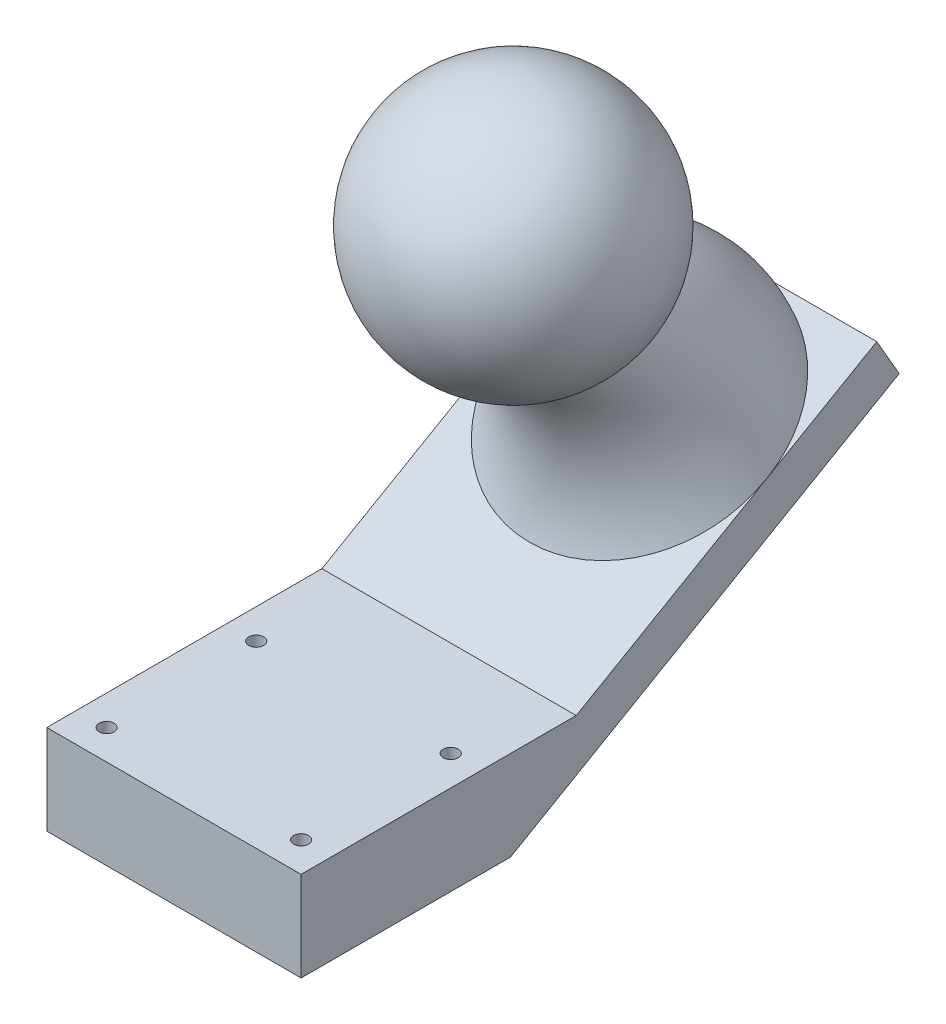
ISO-10303-21;
HEADER;
FILE_DESCRIPTION(('STEP AP214'),'2;1');
FILE_NAME('part.step','',(''),(''),'','','');
FILE_SCHEMA(('AUTOMOTIVE_DESIGN { 1 0 10303 214 1 1 1 1 }'));
ENDSEC;
DATA;
#1=APPLICATION_CONTEXT('core data for automotive mechanical design processes');
#2=APPLICATION_PROTOCOL_DEFINITION('international standard','automotive_design',2000,#1);
#3=PRODUCT_CONTEXT('',#1,'mechanical');
#4=PRODUCT('Part','Part','',(#3));
#5=PRODUCT_RELATED_PRODUCT_CATEGORY('part','',(#4));
#6=PRODUCT_DEFINITION_FORMATION('','',#4);
#7=PRODUCT_DEFINITION_CONTEXT('part definition',#1,'design');
#8=PRODUCT_DEFINITION('design','',#6,#7);
#9=PRODUCT_DEFINITION_SHAPE('','',#8);
#10=(LENGTH_UNIT() NAMED_UNIT(*) SI_UNIT(.MILLI.,.METRE.));
#11=(NAMED_UNIT(*) PLANE_ANGLE_UNIT() SI_UNIT($,.RADIAN.));
#12=(NAMED_UNIT(*) SI_UNIT($,.STERADIAN.) SOLID_ANGLE_UNIT());
#13=UNCERTAINTY_MEASURE_WITH_UNIT(LENGTH_MEASURE(1.E-05),#10,'distance_accuracy_value','');
#14=(GEOMETRIC_REPRESENTATION_CONTEXT(3) GLOBAL_UNCERTAINTY_ASSIGNED_CONTEXT((#13)) GLOBAL_UNIT_ASSIGNED_CONTEXT((#10,
#11,#12)) REPRESENTATION_CONTEXT('',''));
#15=CARTESIAN_POINT('',(0.,0.,0.));
#16=DIRECTION('',(0.,0.,1.));
#17=DIRECTION('',(1.,0.,0.));
#18=AXIS2_PLACEMENT_3D('',#15,#16,#17);
#19=CARTESIAN_POINT('',(8.5,6.,-4.39230484541324));
#20=DIRECTION('',(0.,0.866025403784438,0.500000000000002));
#21=DIRECTION('',(0.,-0.500000000000002,0.866025403784438));
#22=AXIS2_PLACEMENT_3D('',#19,#20,#21);
#23=PLANE('',#22);
#24=DIRECTION('',(0.,0.500000000000002,-0.866025403784438));
#25=VECTOR('',#24,1.);
#26=CARTESIAN_POINT('',(-8.5,6.,-4.39230484541324));
#27=LINE('',#26,#25);
#28=CARTESIAN_POINT('',(-8.5,13.3482129095332,-17.1197829495582));
#29=VERTEX_POINT('',#28);
#30=CARTESIAN_POINT('',(-8.5,17.5980762113534,-24.4807621135331));
#31=VERTEX_POINT('',#30);
#32=EDGE_CURVE('E303',#29,#31,#27,.T.);
#33=ORIENTED_EDGE('',*,*,#32,.F.);
#34=CARTESIAN_POINT('',(0.,13.3480762113533,-17.1195461813654));
#35=DIRECTION('',(0.,0.866025403784438,0.500000000000002));
#36=DIRECTION('',(0.,-0.500000000000002,0.866025403784438));
#37=AXIS2_PLACEMENT_3D('',#34,#35,#36);
#38=CIRCLE('',#37,8.5);
#39=CARTESIAN_POINT('',(0.000270163860237178,17.5980762134011,-24.4807621170799));
#40=VERTEX_POINT('',#39);
#41=EDGE_CURVE('E258',#40,#29,#38,.T.);
#42=ORIENTED_EDGE('',*,*,#41,.F.);
#43=DIRECTION('',(-1.,0.,0.));
#44=VECTOR('',#43,1.);
#45=CARTESIAN_POINT('',(8.5,17.5980762113534,-24.4807621135331));
#46=LINE('',#45,#44);
#47=EDGE_CURVE('E301',#40,#31,#46,.T.);
#48=ORIENTED_EDGE('',*,*,#47,.T.);
#49=EDGE_LOOP('',(#33,#42,#48));
#50=FACE_BOUND('',#49,.T.);
#51=ADVANCED_FACE('F55',(#50),#23,.T.);
#52=CARTESIAN_POINT('',(8.5,17.5980762113534,-24.4807621135331));
#53=VERTEX_POINT('',#52);
#54=EDGE_CURVE('E290',#53,#40,#46,.T.);
#55=ORIENTED_EDGE('',*,*,#54,.T.);
#56=CARTESIAN_POINT('',(8.50000000409541,13.3479411294302,-17.1193122126113));
#57=VERTEX_POINT('',#56);
#58=EDGE_CURVE('E257',#57,#40,#38,.T.);
#59=ORIENTED_EDGE('',*,*,#58,.F.);
#60=DIRECTION('',(0.,0.500000000000002,-0.866025403784438));
#61=VECTOR('',#60,1.);
#62=CARTESIAN_POINT('',(8.5,6.,-4.39230484541324));
#63=LINE('',#62,#61);
#64=EDGE_CURVE('E317',#57,#53,#63,.T.);
#65=ORIENTED_EDGE('',*,*,#64,.T.);
#66=EDGE_LOOP('',(#55,#59,#65));
#67=FACE_BOUND('',#66,.T.);
#68=ADVANCED_FACE('F278',(#67),#23,.T.);
#69=CARTESIAN_POINT('',(8.5,6.,-4.39230484541324));
#70=VERTEX_POINT('',#69);
#71=EDGE_CURVE('E327',#70,#57,#63,.T.);
#72=ORIENTED_EDGE('',*,*,#71,.T.);
#73=CARTESIAN_POINT('',(-8.49999999568817,13.3482129095331,-17.1197829495581));
#74=CARTESIAN_POINT('',(-8.5000046715156,13.2887034850382,-17.0167096028036));
#75=CARTESIAN_POINT('',(-8.49755549484888,13.2292004426964,-16.9136473102628));
#76=CARTESIAN_POINT('',(-8.48771954843888,13.1102952719052,-16.7076975131697));
#77=CARTESIAN_POINT('',(-8.48033266881722,13.0508931457308,-16.6048100125582));
#78=CARTESIAN_POINT('',(-8.45072461534215,12.8729972477273,-16.296685278758));
#79=CARTESIAN_POINT('',(-8.42105605135495,12.7547909079255,-16.0919458924444));
#80=CARTESIAN_POINT('',(-8.34194115452395,12.5202013837619,-15.6856249176696));
#81=CARTESIAN_POINT('',(-8.29251813919331,12.4038162174582,-15.4840398963843));
#82=CARTESIAN_POINT('',(-8.17417754220588,12.173551682799,-15.0852100231734));
#83=CARTESIAN_POINT('',(-8.10526083235084,12.059672202629,-14.8879649775794));
#84=CARTESIAN_POINT('',(-7.94809771028551,11.834757999239,-14.498402149964));
#85=CARTESIAN_POINT('',(-7.85977069841537,11.7237373608183,-14.3061087635307));
#86=CARTESIAN_POINT('',(-7.6646088883301,11.5057899235463,-13.9286127287961));
#87=CARTESIAN_POINT('',(-7.55776698635949,11.3988647153187,-13.7434128355361));
#88=CARTESIAN_POINT('',(-7.32648703191566,11.1899460516747,-13.3815550954552));
#89=CARTESIAN_POINT('',(-7.20205678099877,11.087950436442,-13.2048935077229));
#90=CARTESIAN_POINT('',(-6.93645499379009,10.8894958204098,-12.8611600297586));
#91=CARTESIAN_POINT('',(-6.79527579600948,10.7930393835744,-12.6940925804428));
#92=CARTESIAN_POINT('',(-6.49740607478641,10.6064613933737,-12.370930021841));
#93=CARTESIAN_POINT('',(-6.34073018601016,10.5163339980357,-12.2148247939616));
#94=CARTESIAN_POINT('',(-6.01294982157987,10.3429738106612,-11.9145561414194));
#95=CARTESIAN_POINT('',(-5.84185188736856,10.2597379264236,-11.7703873609069));
#96=CARTESIAN_POINT('',(-5.48626517091618,10.1006578846614,-11.4948526461047));
#97=CARTESIAN_POINT('',(-5.30176965205638,10.0248174912959,-11.3634932315297));
#98=CARTESIAN_POINT('',(-4.92079630012413,9.88114915778041,-11.114652378442));
#99=CARTESIAN_POINT('',(-4.7243227069887,9.81331840710198,-10.9971660719515));
#100=CARTESIAN_POINT('',(-4.31903465673269,9.68562771689373,-10.7759993088573));
#101=CARTESIAN_POINT('',(-4.11013291027329,9.6258370083211,-10.6724387637889));
#102=CARTESIAN_POINT('',(-3.68291608248526,9.51535004836034,-10.481069735563));
#103=CARTESIAN_POINT('',(-3.46460089344501,9.46465390106936,-10.3932614327071));
#104=CARTESIAN_POINT('',(-3.02014171754443,9.37276627920696,-10.2341074030547));
#105=CARTESIAN_POINT('',(-2.7939987325556,9.33157359343237,-10.1627595783929));
#106=CARTESIAN_POINT('',(-2.33550079429345,9.25900737562557,-10.0370712022384));
#107=CARTESIAN_POINT('',(-2.10314597285683,9.22763363538059,-9.98273029011067));
#108=CARTESIAN_POINT('',(-1.63668122758367,9.17523105066468,-9.89196635093478));
#109=CARTESIAN_POINT('',(-1.4026238132527,9.15408524168239,-9.85534073541029));
#110=CARTESIAN_POINT('',(-0.931778886495475,9.12169917804822,-9.79924642773874));
#111=CARTESIAN_POINT('',(-0.694991265740385,9.11045931782318,-9.779778418759));
#112=CARTESIAN_POINT('',(-0.220338080889434,9.09782906898204,-9.75790218605392));
#113=CARTESIAN_POINT('',(0.0175276456158153,9.09644021728159,-9.75549662434455));
#114=CARTESIAN_POINT('',(0.492677739391023,9.10347504253636,-9.76768129910818));
#115=CARTESIAN_POINT('',(0.72996211698129,9.11189854401574,-9.78227123164812));
#116=CARTESIAN_POINT('',(1.20486318836936,9.1388085843262,-9.82888078869957));
#117=CARTESIAN_POINT('',(1.44245540385567,9.15740362315673,-9.86108834072274));
#118=CARTESIAN_POINT('',(1.91360524252567,9.20465237200648,-9.94292557432456));
#119=CARTESIAN_POINT('',(2.14716287538857,9.23330605789083,-9.99255521410038));
#120=CARTESIAN_POINT('',(2.60842788032053,9.30047154516105,-10.1088892505675));
#121=CARTESIAN_POINT('',(2.83613775014163,9.33897905794871,-10.1755862191888));
#122=CARTESIAN_POINT('',(3.28424398240051,9.4255794296032,-10.3255824628488));
#123=CARTESIAN_POINT('',(3.50463755286589,9.47367589975687,-10.4088879928197));
#124=CARTESIAN_POINT('',(3.93385254520007,9.57842964756454,-10.5903268063058));
#125=CARTESIAN_POINT('',(4.14278111315103,9.63497724338792,-10.6882701153178));
#126=CARTESIAN_POINT('',(4.55053616203044,9.75663981363738,-10.8989958683692));
#127=CARTESIAN_POINT('',(4.74935804353668,9.82175864118152,-11.011784986205));
#128=CARTESIAN_POINT('',(5.13549103796111,9.96007195610834,-11.2513506750215));
#129=CARTESIAN_POINT('',(5.32279968622117,10.0332681633202,-11.3781302248338));
#130=CARTESIAN_POINT('',(5.68451116830758,10.18716207373,-11.6446822966391));
#131=CARTESIAN_POINT('',(5.85891964573066,10.2678564613263,-11.7844490758415));
#132=CARTESIAN_POINT('',(6.19537346923552,10.4370373933018,-12.0774790456949));
#133=CARTESIAN_POINT('',(6.35728060925496,10.5255926678275,-12.2308612804516));
#134=CARTESIAN_POINT('',(6.66559840699883,10.7091557605467,-12.5488018834357));
#135=CARTESIAN_POINT('',(6.81201446751631,10.8041613099854,-12.7133563220647));
#136=CARTESIAN_POINT('',(7.08837735624924,11.0000272020441,-13.0526059985801));
#137=CARTESIAN_POINT('',(7.218319230574,11.1008892925317,-13.2273042638621));
#138=CARTESIAN_POINT('',(7.46068520599489,11.3077414443327,-13.5855827004365));
#139=CARTESIAN_POINT('',(7.57310990567126,11.4137313302618,-13.7691625679541));
#140=CARTESIAN_POINT('',(7.77966565539353,11.6302070788897,-14.1441095631841));
#141=CARTESIAN_POINT('',(7.87377855612231,11.7406972721528,-14.335484191654));
#142=CARTESIAN_POINT('',(8.04282489572624,11.965284685763,-14.7244810027672));
#143=CARTESIAN_POINT('',(8.1177588821934,12.0793818030214,-14.9221030068559));
#144=CARTESIAN_POINT('',(8.24780724857376,12.3102192323075,-15.321925162668));
#145=CARTESIAN_POINT('',(8.3029445573503,12.4269563189343,-15.5241197278332));
#146=CARTESIAN_POINT('',(8.39314972476335,12.6623051253161,-15.9317558179872));
#147=CARTESIAN_POINT('',(8.42822723234696,12.7809159155404,-16.1371957329815));
#148=CARTESIAN_POINT('',(8.46886727489162,12.9744816278123,-16.4724613812398));
#149=CARTESIAN_POINT('',(8.48056509334272,13.0491286594026,-16.6017538325884));
#150=CARTESIAN_POINT('',(8.49612465157065,13.1984954980506,-16.8604647860926));
#151=CARTESIAN_POINT('',(8.50000010898411,13.2732149474146,-16.9898826687047));
#152=CARTESIAN_POINT('',(8.49999999578952,13.3479411294303,-17.1193122126116));
#153=B_SPLINE_CURVE_WITH_KNOTS('',3,(#73,#74,#75,#76,#77,#78,#79,#80,#81,#82,#83,#84,#85,#86,
#87,#88,#89,#90,#91,#92,#93,#94,#95,#96,#97,#98,#99,#100,#101,#102,#103,#104,#105,#106,#107,
#108,#109,#110,#111,#112,#113,#114,#115,#116,#117,#118,#119,#120,#121,#122,#123,#124,#125,#126,
#127,#128,#129,#130,#131,#132,#133,#134,#135,#136,#137,#138,#139,#140,#141,#142,#143,#144,#145,
#146,#147,#148,#149,#150,#151,#152),.UNSPECIFIED.,.F.,.F.,(4,2,2,2,2,2,2,2,2,2,2,2,2,2,2,2,2,2,
2,2,2,2,2,2,2,2,2,2,2,2,2,2,2,2,2,2,2,2,2,4),(0.,0.357004706186308,0.714017357039228,
1.42790480233957,2.14095207482741,2.85396746328307,3.57000149847078,4.28631087087501,
5.00230350558294,5.71862492964286,6.43427622290346,7.14960464534207,7.86529527598882,
8.58073402473807,9.30198494270008,10.0232441156373,10.7444113142363,11.4655632192997,
12.1782608390823,12.8909868351847,13.6038240255509,14.3166484683347,15.0372292549094,
15.7578083125234,16.4780742903847,17.1986120409923,17.9105013918265,18.6227118659602,
19.3350742770315,20.0471231758822,20.7661635598748,21.4849523331175,22.2039567405413,
22.9229365734392,23.6426254167442,24.3622937093642,25.0811257598948,25.7996117542024,
26.2486782105421,26.6969564775867),.UNSPECIFIED.);
#154=EDGE_CURVE('E264',#29,#57,#153,.T.);
#155=ORIENTED_EDGE('',*,*,#154,.F.);
#156=CARTESIAN_POINT('',(-8.5,6.,-4.39230484541324));
#157=VERTEX_POINT('',#156);
#158=EDGE_CURVE('E356',#157,#29,#27,.T.);
#159=ORIENTED_EDGE('',*,*,#158,.F.);
#160=DIRECTION('',(-1.,0.,0.));
#161=VECTOR('',#160,1.);
#162=CARTESIAN_POINT('',(8.5,6.,-4.39230484541324));
#163=LINE('',#162,#161);
#164=EDGE_CURVE('E314',#70,#157,#163,.T.);
#165=ORIENTED_EDGE('',*,*,#164,.F.);
#166=EDGE_LOOP('',(#72,#155,#159,#165));
#167=FACE_BOUND('',#166,.T.);
#168=ADVANCED_FACE('F280',(#167),#23,.T.);
#169=CARTESIAN_POINT('',(8.5,0.,14.));
#170=DIRECTION('',(0.,0.,1.));
#171=DIRECTION('',(1.,0.,0.));
#172=AXIS2_PLACEMENT_3D('',#169,#170,#171);
#173=PLANE('',#172);
#174=DIRECTION('',(0.,1.,0.));
#175=VECTOR('',#174,1.);
#176=CARTESIAN_POINT('',(-8.5,0.,14.));
#177=LINE('',#176,#175);
#178=CARTESIAN_POINT('',(-8.5,0.,14.));
#179=VERTEX_POINT('',#178);
#180=CARTESIAN_POINT('',(-8.5,6.,14.));
#181=VERTEX_POINT('',#180);
#182=EDGE_CURVE('E163',#179,#181,#177,.T.);
#183=ORIENTED_EDGE('',*,*,#182,.F.);
#184=DIRECTION('',(-1.,0.,0.));
#185=VECTOR('',#184,1.);
#186=CARTESIAN_POINT('',(8.5,0.,14.));
#187=LINE('',#186,#185);
#188=CARTESIAN_POINT('',(8.5,0.,14.));
#189=VERTEX_POINT('',#188);
#190=EDGE_CURVE('E13',#189,#179,#187,.T.);
#191=ORIENTED_EDGE('',*,*,#190,.F.);
#192=DIRECTION('',(0.,1.,0.));
#193=VECTOR('',#192,1.);
#194=CARTESIAN_POINT('',(8.5,0.,14.));
#195=LINE('',#194,#193);
#196=CARTESIAN_POINT('',(8.5,6.,14.));
#197=VERTEX_POINT('',#196);
#198=EDGE_CURVE('E369',#189,#197,#195,.T.);
#199=ORIENTED_EDGE('',*,*,#198,.T.);
#200=DIRECTION('',(-1.,0.,0.));
#201=VECTOR('',#200,1.);
#202=CARTESIAN_POINT('',(8.5,6.,14.));
#203=LINE('',#202,#201);
#204=EDGE_CURVE('E345',#197,#181,#203,.T.);
#205=ORIENTED_EDGE('',*,*,#204,.T.);
#206=EDGE_LOOP('',(#183,#191,#199,#205));
#207=FACE_BOUND('',#206,.T.);
#208=ADVANCED_FACE('F57',(#207),#173,.T.);
#209=CARTESIAN_POINT('',(8.5,0.,0.));
#210=DIRECTION('',(0.,-1.,0.));
#211=DIRECTION('',(0.,0.,-1.));
#212=AXIS2_PLACEMENT_3D('',#209,#210,#211);
#213=PLANE('',#212);
#214=CARTESIAN_POINT('',(-6.5,0.,2.));
#215=DIRECTION('',(0.,1.,0.));
#216=DIRECTION('',(0.,0.,1.));
#217=AXIS2_PLACEMENT_3D('',#214,#215,#216);
#218=CIRCLE('',#217,0.500000000000001);
#219=CARTESIAN_POINT('',(-6.5,0.,2.5));
#220=VERTEX_POINT('',#219);
#221=EDGE_CURVE('E478',#220,#220,#218,.T.);
#222=ORIENTED_EDGE('',*,*,#221,.T.);
#223=EDGE_LOOP('',(#222));
#224=FACE_BOUND('',#223,.T.);
#225=CARTESIAN_POINT('',(6.5,0.,2.));
#226=DIRECTION('',(0.,1.,0.));
#227=DIRECTION('',(0.,0.,1.));
#228=AXIS2_PLACEMENT_3D('',#225,#226,#227);
#229=CIRCLE('',#228,0.500000000000001);
#230=CARTESIAN_POINT('',(6.5,0.,2.5));
#231=VERTEX_POINT('',#230);
#232=EDGE_CURVE('E530',#231,#231,#229,.T.);
#233=ORIENTED_EDGE('',*,*,#232,.T.);
#234=EDGE_LOOP('',(#233));
#235=FACE_BOUND('',#234,.T.);
#236=CARTESIAN_POINT('',(6.5,0.,12.));
#237=DIRECTION('',(0.,1.,0.));
#238=DIRECTION('',(0.,0.,1.));
#239=AXIS2_PLACEMENT_3D('',#236,#237,#238);
#240=CIRCLE('',#239,0.500000000000001);
#241=CARTESIAN_POINT('',(6.5,0.,12.5));
#242=VERTEX_POINT('',#241);
#243=EDGE_CURVE('E492',#242,#242,#240,.T.);
#244=ORIENTED_EDGE('',*,*,#243,.T.);
#245=EDGE_LOOP('',(#244));
#246=FACE_BOUND('',#245,.T.);
#247=CARTESIAN_POINT('',(-6.5,0.,12.));
#248=DIRECTION('',(0.,1.,0.));
#249=DIRECTION('',(0.,0.,1.));
#250=AXIS2_PLACEMENT_3D('',#247,#248,#249);
#251=CIRCLE('',#250,0.500000000000001);
#252=CARTESIAN_POINT('',(-6.5,0.,12.5));
#253=VERTEX_POINT('',#252);
#254=EDGE_CURVE('E487',#253,#253,#251,.T.);
#255=ORIENTED_EDGE('',*,*,#254,.T.);
#256=EDGE_LOOP('',(#255));
#257=FACE_BOUND('',#256,.T.);
#258=DIRECTION('',(0.,0.,1.));
#259=VECTOR('',#258,1.);
#260=CARTESIAN_POINT('',(-8.5,0.,0.));
#261=LINE('',#260,#259);
#262=CARTESIAN_POINT('',(-8.5,0.,0.));
#263=VERTEX_POINT('',#262);
#264=EDGE_CURVE('E364',#263,#179,#261,.T.);
#265=ORIENTED_EDGE('',*,*,#264,.F.);
#266=DIRECTION('',(-1.,0.,0.));
#267=VECTOR('',#266,1.);
#268=CARTESIAN_POINT('',(8.5,0.,0.));
#269=LINE('',#268,#267);
#270=CARTESIAN_POINT('',(8.5,0.,0.));
#271=VERTEX_POINT('',#270);
#272=EDGE_CURVE('E65',#271,#263,#269,.T.);
#273=ORIENTED_EDGE('',*,*,#272,.F.);
#274=DIRECTION('',(0.,0.,1.));
#275=VECTOR('',#274,1.);
#276=CARTESIAN_POINT('',(8.5,0.,0.));
#277=LINE('',#276,#275);
#278=EDGE_CURVE('E342',#271,#189,#277,.T.);
#279=ORIENTED_EDGE('',*,*,#278,.T.);
#280=ORIENTED_EDGE('',*,*,#190,.T.);
#281=EDGE_LOOP('',(#265,#273,#279,#280));
#282=FACE_BOUND('',#281,.T.);
#283=ADVANCED_FACE('F367',(#224,#235,#246,#257,#282),#213,.T.);
#284=CARTESIAN_POINT('',(8.5,15.,-25.9807621135331));
#285=DIRECTION('',(0.,-0.866025403784438,-0.500000000000001));
#286=DIRECTION('',(0.,0.500000000000001,-0.866025403784438));
#287=AXIS2_PLACEMENT_3D('',#284,#285,#286);
#288=PLANE('',#287);
#289=DIRECTION('',(0.,-0.500000000000001,0.866025403784438));
#290=VECTOR('',#289,1.);
#291=CARTESIAN_POINT('',(-8.5,15.,-25.9807621135331));
#292=LINE('',#291,#290);
#293=CARTESIAN_POINT('',(-8.5,15.,-25.9807621135331));
#294=VERTEX_POINT('',#293);
#295=EDGE_CURVE('E359',#294,#263,#292,.T.);
#296=ORIENTED_EDGE('',*,*,#295,.F.);
#297=DIRECTION('',(-1.,0.,0.));
#298=VECTOR('',#297,1.);
#299=CARTESIAN_POINT('',(8.5,15.,-25.9807621135331));
#300=LINE('',#299,#298);
#301=CARTESIAN_POINT('',(8.5,15.,-25.9807621135331));
#302=VERTEX_POINT('',#301);
#303=EDGE_CURVE('E318',#302,#294,#300,.T.);
#304=ORIENTED_EDGE('',*,*,#303,.F.);
#305=DIRECTION('',(0.,-0.500000000000001,0.866025403784438));
#306=VECTOR('',#305,1.);
#307=CARTESIAN_POINT('',(8.5,15.,-25.9807621135331));
#308=LINE('',#307,#306);
#309=EDGE_CURVE('E339',#302,#271,#308,.T.);
#310=ORIENTED_EDGE('',*,*,#309,.T.);
#311=ORIENTED_EDGE('',*,*,#272,.T.);
#312=EDGE_LOOP('',(#296,#304,#310,#311));
#313=FACE_BOUND('',#312,.T.);
#314=ADVANCED_FACE('F388',(#313),#288,.T.);
#315=CARTESIAN_POINT('',(8.5,17.5980762113534,-24.4807621135331));
#316=DIRECTION('',(0.,0.5,-0.866025403784438));
#317=DIRECTION('',(0.,0.866025403784438,0.5));
#318=AXIS2_PLACEMENT_3D('',#315,#316,#317);
#319=PLANE('',#318);
#320=DIRECTION('',(0.,-0.866025403784438,-0.5));
#321=VECTOR('',#320,1.);
#322=CARTESIAN_POINT('',(-8.5,17.5980762113534,-24.4807621135331));
#323=LINE('',#322,#321);
#324=EDGE_CURVE('E313',#31,#294,#323,.T.);
#325=ORIENTED_EDGE('',*,*,#324,.F.);
#326=ORIENTED_EDGE('',*,*,#47,.F.);
#327=ORIENTED_EDGE('',*,*,#54,.F.);
#328=DIRECTION('',(0.,-0.866025403784438,-0.5));
#329=VECTOR('',#328,1.);
#330=CARTESIAN_POINT('',(8.5,17.5980762113534,-24.4807621135331));
#331=LINE('',#330,#329);
#332=EDGE_CURVE('E331',#53,#302,#331,.T.);
#333=ORIENTED_EDGE('',*,*,#332,.T.);
#334=ORIENTED_EDGE('',*,*,#303,.T.);
#335=EDGE_LOOP('',(#325,#326,#327,#333,#334));
#336=FACE_BOUND('',#335,.T.);
#337=ADVANCED_FACE('F281',(#336),#319,.T.);
#338=CARTESIAN_POINT('',(8.5,6.,14.));
#339=DIRECTION('',(0.,1.,0.));
#340=DIRECTION('',(0.,0.,1.));
#341=AXIS2_PLACEMENT_3D('',#338,#339,#340);
#342=PLANE('',#341);
#343=CARTESIAN_POINT('',(-6.5,6.,2.));
#344=DIRECTION('',(0.,1.,0.));
#345=DIRECTION('',(0.,0.,1.));
#346=AXIS2_PLACEMENT_3D('',#343,#344,#345);
#347=CIRCLE('',#346,0.500000000000001);
#348=CARTESIAN_POINT('',(-6.5,6.,2.5));
#349=VERTEX_POINT('',#348);
#350=EDGE_CURVE('E481',#349,#349,#347,.T.);
#351=ORIENTED_EDGE('',*,*,#350,.F.);
#352=EDGE_LOOP('',(#351));
#353=FACE_BOUND('',#352,.T.);
#354=CARTESIAN_POINT('',(6.5,6.,2.));
#355=DIRECTION('',(0.,1.,0.));
#356=DIRECTION('',(0.,0.,1.));
#357=AXIS2_PLACEMENT_3D('',#354,#355,#356);
#358=CIRCLE('',#357,0.500000000000001);
#359=CARTESIAN_POINT('',(6.5,6.,2.5));
#360=VERTEX_POINT('',#359);
#361=EDGE_CURVE('E483',#360,#360,#358,.T.);
#362=ORIENTED_EDGE('',*,*,#361,.F.);
#363=EDGE_LOOP('',(#362));
#364=FACE_BOUND('',#363,.T.);
#365=CARTESIAN_POINT('',(6.5,6.,12.));
#366=DIRECTION('',(0.,1.,0.));
#367=DIRECTION('',(0.,0.,1.));
#368=AXIS2_PLACEMENT_3D('',#365,#366,#367);
#369=CIRCLE('',#368,0.500000000000001);
#370=CARTESIAN_POINT('',(6.5,6.,12.5));
#371=VERTEX_POINT('',#370);
#372=EDGE_CURVE('E525',#371,#371,#369,.T.);
#373=ORIENTED_EDGE('',*,*,#372,.F.);
#374=EDGE_LOOP('',(#373));
#375=FACE_BOUND('',#374,.T.);
#376=CARTESIAN_POINT('',(-6.5,6.,12.));
#377=DIRECTION('',(0.,1.,0.));
#378=DIRECTION('',(0.,0.,1.));
#379=AXIS2_PLACEMENT_3D('',#376,#377,#378);
#380=CIRCLE('',#379,0.500000000000001);
#381=CARTESIAN_POINT('',(-6.5,6.,12.5));
#382=VERTEX_POINT('',#381);
#383=EDGE_CURVE('E490',#382,#382,#380,.T.);
#384=ORIENTED_EDGE('',*,*,#383,.F.);
#385=EDGE_LOOP('',(#384));
#386=FACE_BOUND('',#385,.T.);
#387=DIRECTION('',(0.,0.,-1.));
#388=VECTOR('',#387,1.);
#389=CARTESIAN_POINT('',(-8.5,6.,14.));
#390=LINE('',#389,#388);
#391=EDGE_CURVE('E348',#181,#157,#390,.T.);
#392=ORIENTED_EDGE('',*,*,#391,.F.);
#393=ORIENTED_EDGE('',*,*,#204,.F.);
#394=DIRECTION('',(0.,0.,-1.));
#395=VECTOR('',#394,1.);
#396=CARTESIAN_POINT('',(8.5,6.,14.));
#397=LINE('',#396,#395);
#398=EDGE_CURVE('E336',#197,#70,#397,.T.);
#399=ORIENTED_EDGE('',*,*,#398,.T.);
#400=ORIENTED_EDGE('',*,*,#164,.T.);
#401=EDGE_LOOP('',(#392,#393,#399,#400));
#402=FACE_BOUND('',#401,.T.);
#403=ADVANCED_FACE('F283',(#353,#364,#375,#386,#402),#342,.T.);
#404=CARTESIAN_POINT('',(8.5,0.,0.));
#405=DIRECTION('',(-1.,0.,0.));
#406=DIRECTION('',(0.,0.,1.));
#407=AXIS2_PLACEMENT_3D('',#404,#405,#406);
#408=PLANE('',#407);
#409=ORIENTED_EDGE('',*,*,#198,.F.);
#410=ORIENTED_EDGE('',*,*,#278,.F.);
#411=ORIENTED_EDGE('',*,*,#309,.F.);
#412=ORIENTED_EDGE('',*,*,#332,.F.);
#413=ORIENTED_EDGE('',*,*,#64,.F.);
#414=ORIENTED_EDGE('',*,*,#71,.F.);
#415=ORIENTED_EDGE('',*,*,#398,.F.);
#416=EDGE_LOOP('',(#409,#410,#411,#412,#413,#414,#415));
#417=FACE_BOUND('',#416,.T.);
#418=ADVANCED_FACE('F380',(#417),#408,.F.);
#419=CARTESIAN_POINT('',(-8.5,0.,0.));
#420=DIRECTION('',(-1.,0.,0.));
#421=DIRECTION('',(0.,0.,1.));
#422=AXIS2_PLACEMENT_3D('',#419,#420,#421);
#423=PLANE('',#422);
#424=ORIENTED_EDGE('',*,*,#182,.T.);
#425=ORIENTED_EDGE('',*,*,#391,.T.);
#426=ORIENTED_EDGE('',*,*,#158,.T.);
#427=ORIENTED_EDGE('',*,*,#32,.T.);
#428=ORIENTED_EDGE('',*,*,#324,.T.);
#429=ORIENTED_EDGE('',*,*,#295,.T.);
#430=ORIENTED_EDGE('',*,*,#264,.T.);
#431=EDGE_LOOP('',(#424,#425,#426,#427,#428,#429,#430));
#432=FACE_BOUND('',#431,.T.);
#433=ADVANCED_FACE('F360',(#432),#423,.T.);
#434=CARTESIAN_POINT('',(0.,9.09807621135333,-9.7583302491977));
#435=CARTESIAN_POINT('',(0.,12.959694341362,-10.7411635651456));
#436=CARTESIAN_POINT('',(0.,16.4297790206435,-10.0848598695608));
#437=CARTESIAN_POINT('',(0.,19.5083302491977,-7.78941916244321));
#438=CARTESIAN_POINT('',(0.234563879217317,9.09807621135333,-9.7583302491977));
#439=CARTESIAN_POINT('',(0.202368836971803,12.959694341362,-10.7411635651456));
#440=CARTESIAN_POINT('',(0.170173794726289,16.4297790206435,-10.0848598695608));
#441=CARTESIAN_POINT('',(0.137978752480774,19.5083302491977,-7.78941916244321));
#442=CARTESIAN_POINT('',(0.699278861808487,9.10759801739247,-9.77482250103729));
#443=CARTESIAN_POINT('',(0.603299410187714,12.9679092328468,-10.7553921745759));
#444=CARTESIAN_POINT('',(0.507319958566942,16.4366869975738,-10.0968248365817));
#445=CARTESIAN_POINT('',(0.411340506946168,19.5139313115737,-7.79912048705474));
#446=CARTESIAN_POINT('',(1.38091838272963,9.14934883185096,-9.84713703293678));
#447=CARTESIAN_POINT('',(1.19138056549223,13.00392954336,-10.8177811824892));
#448=CARTESIAN_POINT('',(1.00184274825483,16.4669768041418,-10.1492883205088));
#449=CARTESIAN_POINT('',(0.812304931017431,19.5384906141963,-7.84165844699562));
#450=CARTESIAN_POINT('',(2.04493032524995,9.21747043899163,-9.96512711759768));
#451=CARTESIAN_POINT('',(1.76425361394113,13.0627011259912,-10.9195765496476));
#452=CARTESIAN_POINT('',(1.48357690263232,16.5163983622634,-10.2348889701647));
#453=CARTESIAN_POINT('',(1.2029001913235,19.5785621478085,-7.91106437914908));
#454=CARTESIAN_POINT('',(5.91006875735552,9.77784096162311,-10.9357173338593));
#455=CARTESIAN_POINT('',(5.0988828494832,13.5461580474771,-11.7569485009321));
#456=CARTESIAN_POINT('',(4.28769694161087,16.9229416826039,-10.9390426564722));
#457=CARTESIAN_POINT('',(3.47651103373854,19.9081918670035,-8.48199980047946));
#458=CARTESIAN_POINT('',(8.5,11.4715651776148,-13.8693337299667));
#459=CARTESIAN_POINT('',(7.33333333333334,15.0074103122543,-14.2879116662012));
#460=CARTESIAN_POINT('',(6.16666666666667,18.1517219961665,-13.067352590903));
#461=CARTESIAN_POINT('',(5.,20.9045002293515,-10.207656504072));
#462=CARTESIAN_POINT('',(8.5,15.6937150035265,-21.1823117456139));
#463=CARTESIAN_POINT('',(7.33333333333334,18.6500493777467,-20.5971476012694));
#464=CARTESIAN_POINT('',(6.16666666666667,21.2148503012397,-18.3728464453921));
#465=CARTESIAN_POINT('',(5.,23.3881177740055,-14.5094082779821));
#466=CARTESIAN_POINT('',(4.69127758434635,17.5980762113534,-24.4807621135331));
#467=CARTESIAN_POINT('',(4.04737673943607,20.2930276746954,-23.4428694873174));
#468=CARTESIAN_POINT('',(3.40347589452579,22.5964456873102,-20.7658398495689));
#469=CARTESIAN_POINT('',(2.7595750496155,24.5083302491977,-16.4496732002876));
#470=CARTESIAN_POINT('',(-4.69127758434635,17.5980762113534,-24.4807621135331));
#471=CARTESIAN_POINT('',(-4.04737673943607,20.2930276746954,-23.4428694873174));
#472=CARTESIAN_POINT('',(-3.40347589452578,22.5964456873102,-20.7658398495689));
#473=CARTESIAN_POINT('',(-2.7595750496155,24.5083302491977,-16.4496732002876));
#474=CARTESIAN_POINT('',(-8.5,15.6937150035265,-21.1823117456139));
#475=CARTESIAN_POINT('',(-7.33333333333333,18.6500493777467,-20.5971476012694));
#476=CARTESIAN_POINT('',(-6.16666666666667,21.2148503012397,-18.3728464453921));
#477=CARTESIAN_POINT('',(-5.,23.3881177740055,-14.5094082779821));
#478=CARTESIAN_POINT('',(-8.5,11.4715651776148,-13.8693337299667));
#479=CARTESIAN_POINT('',(-7.33333333333333,15.0074103122543,-14.2879116662012));
#480=CARTESIAN_POINT('',(-6.16666666666667,18.1517219961665,-13.067352590903));
#481=CARTESIAN_POINT('',(-5.,20.9045002293515,-10.207656504072));
#482=CARTESIAN_POINT('',(-5.91006875735552,9.77784096162311,-10.9357173338593));
#483=CARTESIAN_POINT('',(-5.09888284948319,13.5461580474771,-11.7569485009321));
#484=CARTESIAN_POINT('',(-4.28769694161087,16.9229416826039,-10.9390426564722));
#485=CARTESIAN_POINT('',(-3.47651103373854,19.9081918670035,-8.48199980047946));
#486=CARTESIAN_POINT('',(-2.04493032524995,9.21747043899163,-9.96512711759768));
#487=CARTESIAN_POINT('',(-1.76425361394113,13.0627011259912,-10.9195765496476));
#488=CARTESIAN_POINT('',(-1.48357690263232,16.5163983622634,-10.2348889701647));
#489=CARTESIAN_POINT('',(-1.2029001913235,19.5785621478085,-7.91106437914908));
#490=CARTESIAN_POINT('',(-1.38091838272963,9.14934883185096,-9.84713703293678));
#491=CARTESIAN_POINT('',(-1.19138056549223,13.00392954336,-10.8177811824892));
#492=CARTESIAN_POINT('',(-1.00184274825483,16.4669768041418,-10.1492883205088));
#493=CARTESIAN_POINT('',(-0.812304931017433,19.5384906141963,-7.84165844699562));
#494=CARTESIAN_POINT('',(-0.699278861808489,9.10759801739246,-9.77482250103729));
#495=CARTESIAN_POINT('',(-0.603299410187716,12.9679092328468,-10.7553921745759));
#496=CARTESIAN_POINT('',(-0.507319958566943,16.4366869975738,-10.0968248365817));
#497=CARTESIAN_POINT('',(-0.411340506946171,19.5139313115737,-7.79912048705474));
#498=CARTESIAN_POINT('',(-0.234563879217317,9.09807621135333,-9.7583302491977));
#499=CARTESIAN_POINT('',(-0.202368836971803,12.959694341362,-10.7411635651456));
#500=CARTESIAN_POINT('',(-0.170173794726289,16.4297790206435,-10.0848598695608));
#501=CARTESIAN_POINT('',(-0.137978752480776,19.5083302491977,-7.78941916244321));
#502=CARTESIAN_POINT('',(0.,9.09807621135333,-9.7583302491977));
#503=CARTESIAN_POINT('',(0.,12.959694341362,-10.7411635651456));
#504=CARTESIAN_POINT('',(0.,16.4297790206435,-10.0848598695608));
#505=CARTESIAN_POINT('',(0.,19.5083302491977,-7.78941916244321));
#506=B_SPLINE_SURFACE_WITH_KNOTS('',3,3,((#434,#435,#436,#437),(#438,#439,#440,#441),(#442,#443,
#444,#445),(#446,#447,#448,#449),(#450,#451,#452,#453),(#454,#455,#456,#457),(#458,#459,#460,
#461),(#462,#463,#464,#465),(#466,#467,#468,#469),(#470,#471,#472,#473),(#474,#475,#476,#477),
(#478,#479,#480,#481),(#482,#483,#484,#485),(#486,#487,#488,#489),(#490,#491,#492,#493),(#494,
#495,#496,#497),(#498,#499,#500,#501),(#502,#503,#504,#505)),.UNSPECIFIED.,.T.,.F.,.F.,(4,1,1,1,
1,2,2,2,1,1,1,1,4),(4,4),(0.,0.0125,0.0249999999999999,0.0375000000000001,0.05,0.25,0.5,0.75,
0.95,0.9625,0.975,0.9875,1.),(0.,1.),.UNSPECIFIED.);
#507=CARTESIAN_POINT('',(0.,22.0083302491977,-12.1195461813654));
#508=DIRECTION('',(0.,0.866025403784438,0.500000000000002));
#509=DIRECTION('',(0.,-0.500000000000002,0.866025403784438));
#510=AXIS2_PLACEMENT_3D('',#507,#508,#509);
#511=CIRCLE('',#510,5.);
#512=CARTESIAN_POINT('',(0.,19.5083302491977,-7.78941916244321));
#513=VERTEX_POINT('',#512);
#514=CARTESIAN_POINT('',(2.54928959555651,19.857565161999,-8.39431177519193));
#515=VERTEX_POINT('',#514);
#516=EDGE_CURVE('E150',#513,#515,#511,.T.);
#517=CARTESIAN_POINT('',(-2.54928615127134,19.8575680565531,-8.39431678870667));
#518=VERTEX_POINT('',#517);
#519=EDGE_CURVE('E73',#518,#513,#511,.T.);
#520=CARTESIAN_POINT('',(-4.30153017439748,20.7336854514194,-9.91179663001001));
#521=VERTEX_POINT('',#520);
#522=EDGE_CURVE('E78',#521,#518,#511,.T.);
#523=CARTESIAN_POINT('',(-4.30152438514768,23.2829733249528,-14.327292750089));
#524=VERTEX_POINT('',#523);
#525=EDGE_CURVE('E250',#524,#521,#511,.T.);
#526=CARTESIAN_POINT('',(-2.54928959555734,24.1590953363962,-15.8447805875384));
#527=VERTEX_POINT('',#526);
#528=EDGE_CURVE('E252',#527,#524,#511,.T.);
#529=CARTESIAN_POINT('',(0.,24.5083302491977,-16.4496732002876));
#530=VERTEX_POINT('',#529);
#531=EDGE_CURVE('E253',#530,#527,#511,.T.);
#532=CARTESIAN_POINT('',(0.,19.5083302491977,-7.78941916244321));
#533=CARTESIAN_POINT('',(-0.137978752480776,19.5083302491977,-7.78941916244321));
#534=CARTESIAN_POINT('',(-0.411340506946171,19.5139313115737,-7.79912048705474));
#535=CARTESIAN_POINT('',(-0.812304931017433,19.5384906141963,-7.84165844699562));
#536=CARTESIAN_POINT('',(-1.2029001913235,19.5785621478085,-7.91106437914908));
#537=CARTESIAN_POINT('',(-3.47651103373854,19.9081918670035,-8.48199980047946));
#538=CARTESIAN_POINT('',(-5.,20.9045002293515,-10.207656504072));
#539=CARTESIAN_POINT('',(-5.,23.3881177740055,-14.5094082779821));
#540=CARTESIAN_POINT('',(-2.7595750496155,24.5083302491977,-16.4496732002876));
#541=CARTESIAN_POINT('',(2.7595750496155,24.5083302491977,-16.4496732002876));
#542=CARTESIAN_POINT('',(5.,23.3881177740055,-14.5094082779821));
#543=CARTESIAN_POINT('',(5.,20.9045002293515,-10.207656504072));
#544=CARTESIAN_POINT('',(3.47651103373854,19.9081918670035,-8.48199980047946));
#545=CARTESIAN_POINT('',(1.2029001913235,19.5785621478085,-7.91106437914908));
#546=CARTESIAN_POINT('',(0.812304931017431,19.5384906141963,-7.84165844699562));
#547=CARTESIAN_POINT('',(0.411340506946168,19.5139313115737,-7.79912048705474));
#548=CARTESIAN_POINT('',(0.137978752480774,19.5083302491977,-7.78941916244321));
#549=CARTESIAN_POINT('',(0.,19.5083302491977,-7.78941916244321));
#550=B_SPLINE_CURVE_WITH_KNOTS('',3,(#532,#533,#534,#535,#536,#537,#538,#539,#540,#541,#542,
#543,#544,#545,#546,#547,#548,#549),.UNSPECIFIED.,.T.,.F.,(4,1,1,1,1,2,2,2,1,1,1,1,4),(0.,
0.0125,0.025,0.0375,0.05,0.25,0.5,0.75,0.95,0.9625,0.975,0.9875,1.),.UNSPECIFIED.);
#551=CARTESIAN_POINT('',(2.54928615784962,24.1590924398927,-15.8447755706473));
#552=VERTEX_POINT('',#551);
#553=EDGE_CURVE('E268',#530,#552,#550,.T.);
#554=CARTESIAN_POINT('',(4.30153017439708,23.2829750469763,-14.3272957327213));
#555=VERTEX_POINT('',#554);
#556=EDGE_CURVE('E236',#555,#552,#511,.T.);
#557=CARTESIAN_POINT('',(4.30152438528802,20.7336871735612,-9.91179961284717));
#558=VERTEX_POINT('',#557);
#559=EDGE_CURVE('E153',#558,#555,#511,.T.);
#560=EDGE_CURVE('E59',#515,#558,#511,.T.);
#561=ORIENTED_EDGE('',*,*,#58,.T.);
#562=ORIENTED_EDGE('',*,*,#41,.T.);
#563=ORIENTED_EDGE('',*,*,#154,.T.);
#564=EDGE_LOOP('',(#561,#562,#563));
#565=FACE_BOUND('',#564,.T.);
#566=ORIENTED_EDGE('',*,*,#516,.F.);
#567=ORIENTED_EDGE('',*,*,#519,.F.);
#568=ORIENTED_EDGE('',*,*,#522,.F.);
#569=ORIENTED_EDGE('',*,*,#525,.F.);
#570=ORIENTED_EDGE('',*,*,#528,.F.);
#571=ORIENTED_EDGE('',*,*,#531,.F.);
#572=ORIENTED_EDGE('',*,*,#553,.T.);
#573=ORIENTED_EDGE('',*,*,#556,.F.);
#574=ORIENTED_EDGE('',*,*,#559,.F.);
#575=ORIENTED_EDGE('',*,*,#560,.F.);
#576=EDGE_LOOP('',(#566,#567,#568,#569,#570,#571,#572,#573,#574,#575));
#577=FACE_BOUND('',#576,.T.);
#578=ADVANCED_FACE('F149',(#565,#577),#506,.T.);
#579=CARTESIAN_POINT('',(0.,27.961270699093,-8.68261441014851));
#580=DIRECTION('',(0.,-0.866025403784438,-0.500000000000002));
#581=DIRECTION('',(0.,0.500000000000002,-0.866025403784438));
#582=AXIS2_PLACEMENT_3D('',#579,#580,#581);
#583=SPHERICAL_SURFACE('',#582,8.5);
#584=ORIENTED_EDGE('',*,*,#553,.F.);
#585=ORIENTED_EDGE('',*,*,#531,.T.);
#586=ORIENTED_EDGE('',*,*,#528,.T.);
#587=ORIENTED_EDGE('',*,*,#525,.T.);
#588=ORIENTED_EDGE('',*,*,#522,.T.);
#589=ORIENTED_EDGE('',*,*,#519,.T.);
#590=ORIENTED_EDGE('',*,*,#516,.T.);
#591=ORIENTED_EDGE('',*,*,#560,.T.);
#592=ORIENTED_EDGE('',*,*,#559,.T.);
#593=ORIENTED_EDGE('',*,*,#556,.T.);
#594=EDGE_LOOP('',(#584,#585,#586,#587,#588,#589,#590,#591,#592,#593));
#595=FACE_BOUND('',#594,.T.);
#596=ADVANCED_FACE('F161',(#595),#583,.T.);
#597=CARTESIAN_POINT('',(-6.5,0.,12.));
#598=DIRECTION('',(0.,1.,0.));
#599=DIRECTION('',(0.,0.,1.));
#600=AXIS2_PLACEMENT_3D('',#597,#598,#599);
#601=CYLINDRICAL_SURFACE('',#600,0.500000000000001);
#602=ORIENTED_EDGE('',*,*,#254,.F.);
#603=EDGE_LOOP('',(#602));
#604=FACE_BOUND('',#603,.T.);
#605=ORIENTED_EDGE('',*,*,#383,.T.);
#606=EDGE_LOOP('',(#605));
#607=FACE_BOUND('',#606,.T.);
#608=ADVANCED_FACE('F178',(#604,#607),#601,.F.);
#609=CARTESIAN_POINT('',(6.5,0.,12.));
#610=DIRECTION('',(0.,1.,0.));
#611=DIRECTION('',(0.,0.,1.));
#612=AXIS2_PLACEMENT_3D('',#609,#610,#611);
#613=CYLINDRICAL_SURFACE('',#612,0.500000000000001);
#614=ORIENTED_EDGE('',*,*,#243,.F.);
#615=EDGE_LOOP('',(#614));
#616=FACE_BOUND('',#615,.T.);
#617=ORIENTED_EDGE('',*,*,#372,.T.);
#618=EDGE_LOOP('',(#617));
#619=FACE_BOUND('',#618,.T.);
#620=ADVANCED_FACE('F443',(#616,#619),#613,.F.);
#621=CARTESIAN_POINT('',(6.5,0.,2.));
#622=DIRECTION('',(0.,1.,0.));
#623=DIRECTION('',(0.,0.,1.));
#624=AXIS2_PLACEMENT_3D('',#621,#622,#623);
#625=CYLINDRICAL_SURFACE('',#624,0.500000000000001);
#626=ORIENTED_EDGE('',*,*,#232,.F.);
#627=EDGE_LOOP('',(#626));
#628=FACE_BOUND('',#627,.T.);
#629=ORIENTED_EDGE('',*,*,#361,.T.);
#630=EDGE_LOOP('',(#629));
#631=FACE_BOUND('',#630,.T.);
#632=ADVANCED_FACE('F452',(#628,#631),#625,.F.);
#633=CARTESIAN_POINT('',(-6.5,0.,2.));
#634=DIRECTION('',(0.,1.,0.));
#635=DIRECTION('',(0.,0.,1.));
#636=AXIS2_PLACEMENT_3D('',#633,#634,#635);
#637=CYLINDRICAL_SURFACE('',#636,0.500000000000001);
#638=ORIENTED_EDGE('',*,*,#221,.F.);
#639=EDGE_LOOP('',(#638));
#640=FACE_BOUND('',#639,.T.);
#641=ORIENTED_EDGE('',*,*,#350,.T.);
#642=EDGE_LOOP('',(#641));
#643=FACE_BOUND('',#642,.T.);
#644=ADVANCED_FACE('F462',(#640,#643),#637,.F.);
#645=CLOSED_SHELL('',(#51,#68,#168,#208,#283,#314,#337,#403,#418,#433,#578,#596,#608,#620,#632,#644));
#646=MANIFOLD_SOLID_BREP('B2',#645);
#647=ADVANCED_BREP_SHAPE_REPRESENTATION('',(#18,#646),#14);
#648=SHAPE_DEFINITION_REPRESENTATION(#9,#647);
ENDSEC;
END-ISO-10303-21;
